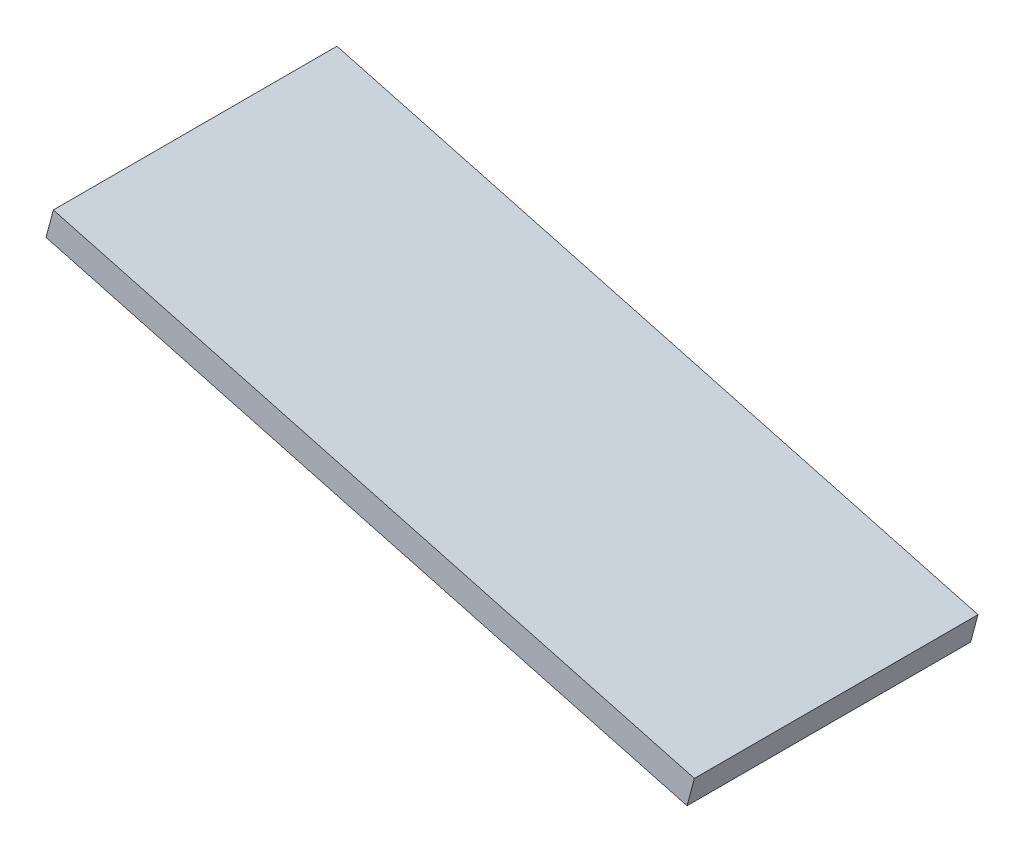
ISO-10303-21;
HEADER;
FILE_DESCRIPTION(('STEP AP214'),'2;1');
FILE_NAME('part.step','',(''),(''),'','','');
FILE_SCHEMA(('AUTOMOTIVE_DESIGN { 1 0 10303 214 1 1 1 1 }'));
ENDSEC;
DATA;
#1=APPLICATION_CONTEXT('core data for automotive mechanical design processes');
#2=APPLICATION_PROTOCOL_DEFINITION('international standard','automotive_design',2000,#1);
#3=PRODUCT_CONTEXT('',#1,'mechanical');
#4=PRODUCT('Part','Part','',(#3));
#5=PRODUCT_RELATED_PRODUCT_CATEGORY('part','',(#4));
#6=PRODUCT_DEFINITION_FORMATION('','',#4);
#7=PRODUCT_DEFINITION_CONTEXT('part definition',#1,'design');
#8=PRODUCT_DEFINITION('design','',#6,#7);
#9=PRODUCT_DEFINITION_SHAPE('','',#8);
#10=(LENGTH_UNIT() NAMED_UNIT(*) SI_UNIT(.MILLI.,.METRE.));
#11=(NAMED_UNIT(*) PLANE_ANGLE_UNIT() SI_UNIT($,.RADIAN.));
#12=(NAMED_UNIT(*) SI_UNIT($,.STERADIAN.) SOLID_ANGLE_UNIT());
#13=UNCERTAINTY_MEASURE_WITH_UNIT(LENGTH_MEASURE(1.E-05),#10,'distance_accuracy_value','');
#14=(GEOMETRIC_REPRESENTATION_CONTEXT(3) GLOBAL_UNCERTAINTY_ASSIGNED_CONTEXT((#13)) GLOBAL_UNIT_ASSIGNED_CONTEXT((#10,
#11,#12)) REPRESENTATION_CONTEXT('',''));
#15=CARTESIAN_POINT('',(0.,0.,0.));
#16=DIRECTION('',(0.,0.,1.));
#17=DIRECTION('',(1.,0.,0.));
#18=AXIS2_PLACEMENT_3D('',#15,#16,#17);
#19=CARTESIAN_POINT('',(2.5,235.,35.));
#20=DIRECTION('',(-0.258819045102525,-0.965925826289067,0.));
#21=DIRECTION('',(0.965925826289067,-0.258819045102525,0.));
#22=AXIS2_PLACEMENT_3D('',#19,#20,#21);
#23=PLANE('',#22);
#24=DIRECTION('',(0.,0.,1.));
#25=VECTOR('',#24,1.);
#26=CARTESIAN_POINT('',(115.513321675821,204.718171723005,35.));
#27=LINE('',#26,#25);
#28=CARTESIAN_POINT('',(115.513321675821,204.718171723005,35.));
#29=VERTEX_POINT('',#28);
#30=CARTESIAN_POINT('',(115.513321675821,204.718171723005,85.));
#31=VERTEX_POINT('',#30);
#32=EDGE_CURVE('E45',#29,#31,#27,.T.);
#33=ORIENTED_EDGE('',*,*,#32,.T.);
#34=DIRECTION('',(0.965925826289067,-0.258819045102525,0.));
#35=VECTOR('',#34,1.);
#36=CARTESIAN_POINT('',(2.5,235.,85.));
#37=LINE('',#36,#35);
#38=CARTESIAN_POINT('',(2.5,235.,85.));
#39=VERTEX_POINT('',#38);
#40=EDGE_CURVE('E83',#39,#31,#37,.T.);
#41=ORIENTED_EDGE('',*,*,#40,.F.);
#42=DIRECTION('',(0.,0.,1.));
#43=VECTOR('',#42,1.);
#44=CARTESIAN_POINT('',(2.5,235.,35.));
#45=LINE('',#44,#43);
#46=CARTESIAN_POINT('',(2.5,235.,35.));
#47=VERTEX_POINT('',#46);
#48=EDGE_CURVE('E11',#47,#39,#45,.T.);
#49=ORIENTED_EDGE('',*,*,#48,.F.);
#50=DIRECTION('',(0.965925826289067,-0.258819045102525,0.));
#51=VECTOR('',#50,1.);
#52=CARTESIAN_POINT('',(2.5,235.,35.));
#53=LINE('',#52,#51);
#54=EDGE_CURVE('E85',#47,#29,#53,.T.);
#55=ORIENTED_EDGE('',*,*,#54,.T.);
#56=EDGE_LOOP('',(#33,#41,#49,#55));
#57=FACE_BOUND('',#56,.T.);
#58=ADVANCED_FACE('F42',(#57),#23,.T.);
#59=CARTESIAN_POINT('',(2.5,235.,35.));
#60=DIRECTION('',(0.965925826289067,-0.258819045102525,0.));
#61=DIRECTION('',(0.258819045102525,0.965925826289067,0.));
#62=AXIS2_PLACEMENT_3D('',#59,#60,#61);
#63=PLANE('',#62);
#64=ORIENTED_EDGE('',*,*,#48,.T.);
#65=DIRECTION('',(0.258819045102525,0.965925826289067,0.));
#66=VECTOR('',#65,1.);
#67=CARTESIAN_POINT('',(2.5,235.,85.));
#68=LINE('',#67,#66);
#69=CARTESIAN_POINT('',(3.79409522551263,239.829629131445,85.));
#70=VERTEX_POINT('',#69);
#71=EDGE_CURVE('E98',#39,#70,#68,.T.);
#72=ORIENTED_EDGE('',*,*,#71,.T.);
#73=DIRECTION('',(0.,0.,1.));
#74=VECTOR('',#73,1.);
#75=CARTESIAN_POINT('',(3.79409522551263,239.829629131445,35.));
#76=LINE('',#75,#74);
#77=CARTESIAN_POINT('',(3.79409522551263,239.829629131445,35.));
#78=VERTEX_POINT('',#77);
#79=EDGE_CURVE('E51',#78,#70,#76,.T.);
#80=ORIENTED_EDGE('',*,*,#79,.F.);
#81=DIRECTION('',(0.258819045102525,0.965925826289067,0.));
#82=VECTOR('',#81,1.);
#83=CARTESIAN_POINT('',(2.5,235.,35.));
#84=LINE('',#83,#82);
#85=EDGE_CURVE('E64',#47,#78,#84,.T.);
#86=ORIENTED_EDGE('',*,*,#85,.F.);
#87=EDGE_LOOP('',(#64,#72,#80,#86));
#88=FACE_BOUND('',#87,.T.);
#89=ADVANCED_FACE('F138',(#88),#63,.F.);
#90=CARTESIAN_POINT('',(3.79409522551263,239.829629131445,35.));
#91=DIRECTION('',(-0.258819045102525,-0.965925826289067,0.));
#92=DIRECTION('',(0.965925826289067,-0.258819045102525,0.));
#93=AXIS2_PLACEMENT_3D('',#90,#91,#92);
#94=PLANE('',#93);
#95=ORIENTED_EDGE('',*,*,#79,.T.);
#96=DIRECTION('',(0.965925826289067,-0.258819045102525,0.));
#97=VECTOR('',#96,1.);
#98=CARTESIAN_POINT('',(3.79409522551263,239.829629131445,85.));
#99=LINE('',#98,#97);
#100=CARTESIAN_POINT('',(116.807416901334,209.54780085445,85.));
#101=VERTEX_POINT('',#100);
#102=EDGE_CURVE('E104',#70,#101,#99,.T.);
#103=ORIENTED_EDGE('',*,*,#102,.T.);
#104=DIRECTION('',(0.,0.,1.));
#105=VECTOR('',#104,1.);
#106=CARTESIAN_POINT('',(116.807416901334,209.54780085445,35.));
#107=LINE('',#106,#105);
#108=CARTESIAN_POINT('',(116.807416901334,209.54780085445,35.));
#109=VERTEX_POINT('',#108);
#110=EDGE_CURVE('E90',#109,#101,#107,.T.);
#111=ORIENTED_EDGE('',*,*,#110,.F.);
#112=DIRECTION('',(0.965925826289067,-0.258819045102525,0.));
#113=VECTOR('',#112,1.);
#114=CARTESIAN_POINT('',(3.79409522551263,239.829629131445,35.));
#115=LINE('',#114,#113);
#116=EDGE_CURVE('E118',#78,#109,#115,.T.);
#117=ORIENTED_EDGE('',*,*,#116,.F.);
#118=EDGE_LOOP('',(#95,#103,#111,#117));
#119=FACE_BOUND('',#118,.T.);
#120=ADVANCED_FACE('F136',(#119),#94,.F.);
#121=CARTESIAN_POINT('',(116.807416901334,209.54780085445,35.));
#122=DIRECTION('',(-0.965925826289065,0.258819045102532,0.));
#123=DIRECTION('',(-0.258819045102532,-0.965925826289065,0.));
#124=AXIS2_PLACEMENT_3D('',#121,#122,#123);
#125=PLANE('',#124);
#126=ORIENTED_EDGE('',*,*,#110,.T.);
#127=DIRECTION('',(-0.258819045102532,-0.965925826289065,0.));
#128=VECTOR('',#127,1.);
#129=CARTESIAN_POINT('',(116.807416901334,209.54780085445,85.));
#130=LINE('',#129,#128);
#131=EDGE_CURVE('E95',#101,#31,#130,.T.);
#132=ORIENTED_EDGE('',*,*,#131,.T.);
#133=ORIENTED_EDGE('',*,*,#32,.F.);
#134=DIRECTION('',(-0.258819045102532,-0.965925826289065,0.));
#135=VECTOR('',#134,1.);
#136=CARTESIAN_POINT('',(116.807416901334,209.54780085445,35.));
#137=LINE('',#136,#135);
#138=EDGE_CURVE('E116',#109,#29,#137,.T.);
#139=ORIENTED_EDGE('',*,*,#138,.F.);
#140=EDGE_LOOP('',(#126,#132,#133,#139));
#141=FACE_BOUND('',#140,.T.);
#142=ADVANCED_FACE('F101',(#141),#125,.F.);
#143=CARTESIAN_POINT('',(0.,0.,35.));
#144=DIRECTION('',(0.,0.,-1.));
#145=DIRECTION('',(-1.,0.,0.));
#146=AXIS2_PLACEMENT_3D('',#143,#144,#145);
#147=PLANE('',#146);
#148=ORIENTED_EDGE('',*,*,#54,.F.);
#149=ORIENTED_EDGE('',*,*,#85,.T.);
#150=ORIENTED_EDGE('',*,*,#116,.T.);
#151=ORIENTED_EDGE('',*,*,#138,.T.);
#152=EDGE_LOOP('',(#148,#149,#150,#151));
#153=FACE_BOUND('',#152,.T.);
#154=ADVANCED_FACE('F139',(#153),#147,.T.);
#155=CARTESIAN_POINT('',(0.,0.,85.));
#156=DIRECTION('',(0.,0.,-1.));
#157=DIRECTION('',(-1.,0.,0.));
#158=AXIS2_PLACEMENT_3D('',#155,#156,#157);
#159=PLANE('',#158);
#160=ORIENTED_EDGE('',*,*,#40,.T.);
#161=ORIENTED_EDGE('',*,*,#131,.F.);
#162=ORIENTED_EDGE('',*,*,#102,.F.);
#163=ORIENTED_EDGE('',*,*,#71,.F.);
#164=EDGE_LOOP('',(#160,#161,#162,#163));
#165=FACE_BOUND('',#164,.T.);
#166=ADVANCED_FACE('F93',(#165),#159,.F.);
#167=CLOSED_SHELL('',(#58,#89,#120,#142,#154,#166));
#168=MANIFOLD_SOLID_BREP('B2',#167);
#169=ADVANCED_BREP_SHAPE_REPRESENTATION('',(#18,#168),#14);
#170=SHAPE_DEFINITION_REPRESENTATION(#9,#169);
ENDSEC;
END-ISO-10303-21;
